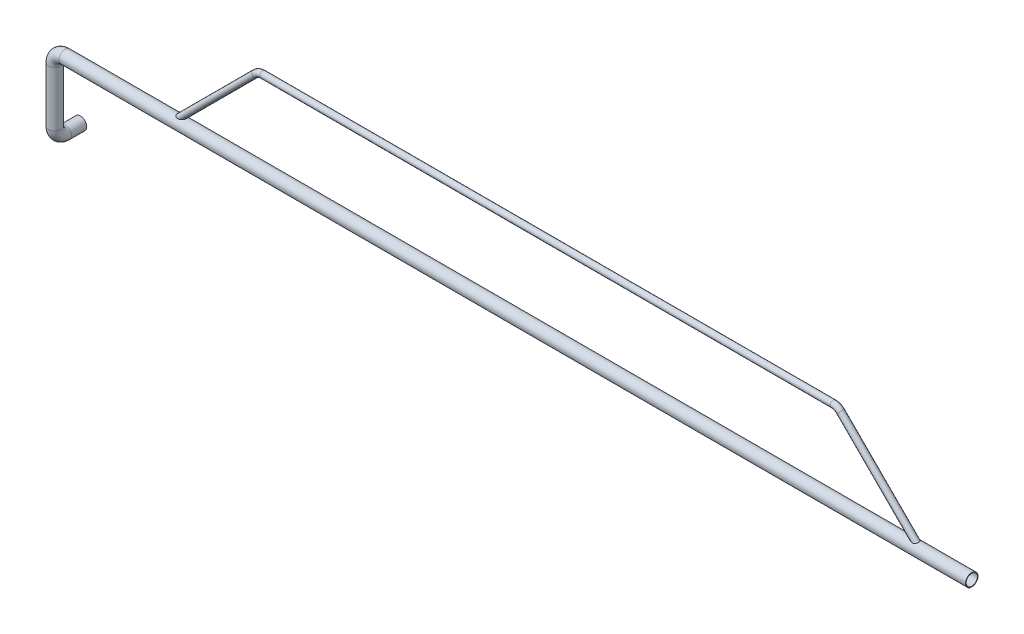
ISO-10303-21;
HEADER;
FILE_DESCRIPTION(('STEP AP214'),'2;1');
FILE_NAME('part.step','',(''),(''),'','','');
FILE_SCHEMA(('AUTOMOTIVE_DESIGN { 1 0 10303 214 1 1 1 1 }'));
ENDSEC;
DATA;
#1=APPLICATION_CONTEXT('core data for automotive mechanical design processes');
#2=APPLICATION_PROTOCOL_DEFINITION('international standard','automotive_design',2000,#1);
#3=PRODUCT_CONTEXT('',#1,'mechanical');
#4=PRODUCT('Part','Part','',(#3));
#5=PRODUCT_RELATED_PRODUCT_CATEGORY('part','',(#4));
#6=PRODUCT_DEFINITION_FORMATION('','',#4);
#7=PRODUCT_DEFINITION_CONTEXT('part definition',#1,'design');
#8=PRODUCT_DEFINITION('design','',#6,#7);
#9=PRODUCT_DEFINITION_SHAPE('','',#8);
#10=(LENGTH_UNIT() NAMED_UNIT(*) SI_UNIT(.MILLI.,.METRE.));
#11=(NAMED_UNIT(*) PLANE_ANGLE_UNIT() SI_UNIT($,.RADIAN.));
#12=(NAMED_UNIT(*) SI_UNIT($,.STERADIAN.) SOLID_ANGLE_UNIT());
#13=UNCERTAINTY_MEASURE_WITH_UNIT(LENGTH_MEASURE(1.E-05),#10,'distance_accuracy_value','');
#14=(GEOMETRIC_REPRESENTATION_CONTEXT(3) GLOBAL_UNCERTAINTY_ASSIGNED_CONTEXT((#13)) GLOBAL_UNIT_ASSIGNED_CONTEXT((#10,
#11,#12)) REPRESENTATION_CONTEXT('',''));
#15=CARTESIAN_POINT('',(0.,0.,0.));
#16=DIRECTION('',(0.,0.,1.));
#17=DIRECTION('',(1.,0.,0.));
#18=AXIS2_PLACEMENT_3D('',#15,#16,#17);
#19=CARTESIAN_POINT('',(-25137.374453509,-8356.2045132641,38950.2492567147));
#20=DIRECTION('',(0.707106781186541,-0.707106781186553,0.));
#21=DIRECTION('',(0.707106781186553,0.707106781186541,0.));
#22=AXIS2_PLACEMENT_3D('',#19,#20,#21);
#23=PLANE('',#22);
#24=CARTESIAN_POINT('',(-25137.374453509,-8356.2045132641,38950.2492567147));
#25=DIRECTION('',(0.707106781186541,-0.707106781186553,0.));
#26=DIRECTION('',(0.707106781186553,0.707106781186542,0.));
#27=AXIS2_PLACEMENT_3D('',#24,#25,#26);
#28=CIRCLE('',#27,12.0000000000006);
#29=CARTESIAN_POINT('',(-25128.8891721347,-8347.71923188986,38950.2492567147));
#30=VERTEX_POINT('',#29);
#31=EDGE_CURVE('E96',#30,#30,#28,.T.);
#32=ORIENTED_EDGE('',*,*,#31,.F.);
#33=EDGE_LOOP('',(#32));
#34=FACE_BOUND('',#33,.T.);
#35=CARTESIAN_POINT('',(-25137.374453509,-8356.2045132641,38950.2492567147));
#36=DIRECTION('',(0.707106781186541,-0.707106781186553,0.));
#37=DIRECTION('',(0.707106781186553,0.707106781186541,0.));
#38=AXIS2_PLACEMENT_3D('',#35,#36,#37);
#39=CIRCLE('',#38,15.0000000000006);
#40=CARTESIAN_POINT('',(-25126.7678517912,-8345.59791154631,38950.2492567147));
#41=VERTEX_POINT('',#40);
#42=EDGE_CURVE('E89',#41,#41,#39,.T.);
#43=ORIENTED_EDGE('',*,*,#42,.T.);
#44=EDGE_LOOP('',(#43));
#45=FACE_BOUND('',#44,.T.);
#46=ADVANCED_FACE('F67',(#34,#45),#23,.T.);
#47=CARTESIAN_POINT('',(-28718.197596503,-8356.2045132641,38950.2492567147));
#48=DIRECTION('',(0.707106781186553,0.707106781186542,0.));
#49=DIRECTION('',(-0.707106781186542,0.707106781186553,0.));
#50=AXIS2_PLACEMENT_3D('',#47,#48,#49);
#51=PLANE('',#50);
#52=CARTESIAN_POINT('',(-28718.197596503,-8356.2045132641,38950.2492567147));
#53=DIRECTION('',(0.707106781186553,0.707106781186542,0.));
#54=DIRECTION('',(-0.707106781186542,0.707106781186553,0.));
#55=AXIS2_PLACEMENT_3D('',#52,#53,#54);
#56=CIRCLE('',#55,12.0000000000006);
#57=CARTESIAN_POINT('',(-28726.6828778773,-8347.71923188986,38950.2492567147));
#58=VERTEX_POINT('',#57);
#59=EDGE_CURVE('E92',#58,#58,#56,.T.);
#60=ORIENTED_EDGE('',*,*,#59,.T.);
#61=EDGE_LOOP('',(#60));
#62=FACE_BOUND('',#61,.T.);
#63=CARTESIAN_POINT('',(-28718.197596503,-8356.2045132641,38950.2492567147));
#64=DIRECTION('',(0.707106781186553,0.707106781186542,0.));
#65=DIRECTION('',(-0.707106781186542,0.707106781186553,0.));
#66=AXIS2_PLACEMENT_3D('',#63,#64,#65);
#67=CIRCLE('',#66,15.0000000000006);
#68=CARTESIAN_POINT('',(-28728.8041982208,-8345.5979115463,38950.2492567147));
#69=VERTEX_POINT('',#68);
#70=EDGE_CURVE('E12',#69,#69,#67,.T.);
#71=ORIENTED_EDGE('',*,*,#70,.F.);
#72=EDGE_LOOP('',(#71));
#73=FACE_BOUND('',#72,.T.);
#74=ADVANCED_FACE('F122',(#62,#73),#51,.F.);
#75=CARTESIAN_POINT('',(-25137.374453509,-8356.2045132641,38950.2492567147));
#76=DIRECTION('',(-0.707106781186548,0.707106781186548,0.));
#77=DIRECTION('',(-0.707106781186548,-0.707106781186548,0.));
#78=AXIS2_PLACEMENT_3D('',#75,#76,#77);
#79=CYLINDRICAL_SURFACE('',#78,15.0000000000006);
#80=CARTESIAN_POINT('',(-25522.7297925683,-7970.84917420477,38950.2492567147));
#81=DIRECTION('',(0.707106781186541,-0.707106781186553,0.));
#82=DIRECTION('',(0.707106781186553,0.707106781186541,0.));
#83=AXIS2_PLACEMENT_3D('',#80,#81,#82);
#84=CIRCLE('',#83,15.0000000000006);
#85=CARTESIAN_POINT('',(-25512.1231908505,-7960.24257248697,38950.2492567147));
#86=VERTEX_POINT('',#85);
#87=EDGE_CURVE('E86',#86,#86,#84,.T.);
#88=ORIENTED_EDGE('',*,*,#87,.T.);
#89=EDGE_LOOP('',(#88));
#90=FACE_BOUND('',#89,.T.);
#91=ORIENTED_EDGE('',*,*,#42,.F.);
#92=EDGE_LOOP('',(#91));
#93=FACE_BOUND('',#92,.T.);
#94=ADVANCED_FACE('F126',(#90,#93),#79,.T.);
#95=CARTESIAN_POINT('',(-25558.0851316276,-8006.2045132641,38950.2492567147));
#96=DIRECTION('',(0.,0.,1.));
#97=DIRECTION('',(1.,0.,0.));
#98=AXIS2_PLACEMENT_3D('',#95,#96,#97);
#99=TOROIDAL_SURFACE('',#98,49.9999999999986,15.0000000000006);
#100=CARTESIAN_POINT('',(-25558.0851316276,-7956.2045132641,38950.2492567147));
#101=DIRECTION('',(1.,0.,0.));
#102=DIRECTION('',(0.,1.,0.));
#103=AXIS2_PLACEMENT_3D('',#100,#101,#102);
#104=CIRCLE('',#103,15.0000000000006);
#105=CARTESIAN_POINT('',(-25558.0851316276,-7941.2045132641,38950.2492567147));
#106=VERTEX_POINT('',#105);
#107=EDGE_CURVE('E81',#106,#106,#104,.T.);
#108=CARTESIAN_POINT('',(-25558.0851316276,-8006.2045132641,38950.2492567147));
#109=DIRECTION('',(0.,0.,1.));
#110=DIRECTION('',(1.,0.,0.));
#111=AXIS2_PLACEMENT_3D('',#108,#109,#110);
#112=CIRCLE('',#111,64.9999999999992);
#113=EDGE_CURVE('',#86,#106,#112,.T.);
#114=ORIENTED_EDGE('',*,*,#87,.F.);
#115=ORIENTED_EDGE('',*,*,#107,.T.);
#116=ORIENTED_EDGE('',*,*,#113,.T.);
#117=ORIENTED_EDGE('',*,*,#113,.F.);
#118=EDGE_LOOP('',(#114,#116,#115,#117));
#119=FACE_BOUND('',#118,.T.);
#120=ADVANCED_FACE('F128',(#119),#99,.T.);
#121=CARTESIAN_POINT('',(-25558.0851316276,-7956.2045132641,38950.2492567147));
#122=DIRECTION('',(-1.,0.,0.));
#123=DIRECTION('',(0.,0.,1.));
#124=AXIS2_PLACEMENT_3D('',#121,#122,#123);
#125=CYLINDRICAL_SURFACE('',#124,15.0000000000006);
#126=CARTESIAN_POINT('',(-28297.4869183844,-7956.2045132641,38950.2492567147));
#127=DIRECTION('',(1.,0.,0.));
#128=DIRECTION('',(0.,1.,0.));
#129=AXIS2_PLACEMENT_3D('',#126,#127,#128);
#130=CIRCLE('',#129,15.0000000000006);
#131=CARTESIAN_POINT('',(-28297.4869183844,-7941.2045132641,38950.2492567147));
#132=VERTEX_POINT('',#131);
#133=EDGE_CURVE('E77',#132,#132,#130,.T.);
#134=ORIENTED_EDGE('',*,*,#133,.T.);
#135=EDGE_LOOP('',(#134));
#136=FACE_BOUND('',#135,.T.);
#137=ORIENTED_EDGE('',*,*,#107,.F.);
#138=EDGE_LOOP('',(#137));
#139=FACE_BOUND('',#138,.T.);
#140=ADVANCED_FACE('F135',(#136,#139),#125,.T.);
#141=CARTESIAN_POINT('',(-28297.4869183844,-8006.2045132641,38950.2492567147));
#142=DIRECTION('',(0.,0.,1.));
#143=DIRECTION('',(1.,0.,0.));
#144=AXIS2_PLACEMENT_3D('',#141,#142,#143);
#145=TOROIDAL_SURFACE('',#144,50.0000000000025,15.0000000000006);
#146=CARTESIAN_POINT('',(-28332.8422574438,-7970.84917420444,38950.2492567147));
#147=DIRECTION('',(0.707106781186553,0.707106781186542,0.));
#148=DIRECTION('',(-0.707106781186542,0.707106781186553,0.));
#149=AXIS2_PLACEMENT_3D('',#146,#147,#148);
#150=CIRCLE('',#149,15.0000000000006);
#151=CARTESIAN_POINT('',(-28343.4488591614,-7960.24257248682,38950.2492567147));
#152=VERTEX_POINT('',#151);
#153=EDGE_CURVE('E73',#152,#152,#150,.T.);
#154=CARTESIAN_POINT('',(-28297.4869183844,-8006.2045132641,38950.2492567147));
#155=DIRECTION('',(0.,0.,1.));
#156=DIRECTION('',(1.,0.,0.));
#157=AXIS2_PLACEMENT_3D('',#154,#155,#156);
#158=CIRCLE('',#157,65.0000000000031);
#159=EDGE_CURVE('',#132,#152,#158,.T.);
#160=ORIENTED_EDGE('',*,*,#133,.F.);
#161=ORIENTED_EDGE('',*,*,#153,.T.);
#162=ORIENTED_EDGE('',*,*,#159,.T.);
#163=ORIENTED_EDGE('',*,*,#159,.F.);
#164=EDGE_LOOP('',(#160,#162,#161,#163));
#165=FACE_BOUND('',#164,.T.);
#166=ADVANCED_FACE('F141',(#165),#145,.T.);
#167=CARTESIAN_POINT('',(-28332.8422574437,-7970.84917420477,38950.2492567147));
#168=DIRECTION('',(-0.707106781186547,-0.707106781186548,0.));
#169=DIRECTION('',(0.707106781186548,-0.707106781186547,0.));
#170=AXIS2_PLACEMENT_3D('',#167,#168,#169);
#171=CYLINDRICAL_SURFACE('',#170,15.0000000000006);
#172=ORIENTED_EDGE('',*,*,#70,.T.);
#173=EDGE_LOOP('',(#172));
#174=FACE_BOUND('',#173,.T.);
#175=ORIENTED_EDGE('',*,*,#153,.F.);
#176=EDGE_LOOP('',(#175));
#177=FACE_BOUND('',#176,.T.);
#178=ADVANCED_FACE('F116',(#174,#177),#171,.T.);
#179=CARTESIAN_POINT('',(-25137.374453509,-8356.2045132641,38950.2492567147));
#180=DIRECTION('',(-0.707106781186548,0.707106781186548,0.));
#181=DIRECTION('',(-0.707106781186548,-0.707106781186548,0.));
#182=AXIS2_PLACEMENT_3D('',#179,#180,#181);
#183=CYLINDRICAL_SURFACE('',#182,12.0000000000006);
#184=CARTESIAN_POINT('',(-25522.7297925683,-7970.84917420478,38950.2492567147));
#185=DIRECTION('',(-0.707106781186548,0.707106781186548,0.));
#186=DIRECTION('',(-0.707106781186548,-0.707106781186548,0.));
#187=AXIS2_PLACEMENT_3D('',#184,#185,#186);
#188=CIRCLE('',#187,12.0000000000006);
#189=CARTESIAN_POINT('',(-25514.244511194,-7962.36389283053,38950.2492567147));
#190=VERTEX_POINT('',#189);
#191=EDGE_CURVE('E99',#190,#190,#188,.F.);
#192=ORIENTED_EDGE('',*,*,#191,.F.);
#193=EDGE_LOOP('',(#192));
#194=FACE_BOUND('',#193,.T.);
#195=ORIENTED_EDGE('',*,*,#31,.T.);
#196=EDGE_LOOP('',(#195));
#197=FACE_BOUND('',#196,.T.);
#198=ADVANCED_FACE('F113',(#194,#197),#183,.F.);
#199=CARTESIAN_POINT('',(-25558.0851316276,-8006.2045132641,38950.2492567147));
#200=DIRECTION('',(0.,0.,1.));
#201=DIRECTION('',(1.,0.,0.));
#202=AXIS2_PLACEMENT_3D('',#199,#200,#201);
#203=TOROIDAL_SURFACE('',#202,49.9999999999986,12.0000000000006);
#204=CARTESIAN_POINT('',(-25558.0851316276,-7956.2045132641,38950.2492567147));
#205=DIRECTION('',(1.,0.,0.));
#206=DIRECTION('',(0.,1.,0.));
#207=AXIS2_PLACEMENT_3D('',#204,#205,#206);
#208=CIRCLE('',#207,12.0000000000006);
#209=CARTESIAN_POINT('',(-25558.0851316276,-7944.2045132641,38950.2492567147));
#210=VERTEX_POINT('',#209);
#211=EDGE_CURVE('E105',#210,#210,#208,.T.);
#212=CARTESIAN_POINT('',(-25558.0851316276,-8006.2045132641,38950.2492567147));
#213=DIRECTION('',(0.,0.,1.));
#214=DIRECTION('',(1.,0.,0.));
#215=AXIS2_PLACEMENT_3D('',#212,#213,#214);
#216=CIRCLE('',#215,61.9999999999992);
#217=EDGE_CURVE('',#190,#210,#216,.T.);
#218=ORIENTED_EDGE('',*,*,#191,.T.);
#219=ORIENTED_EDGE('',*,*,#211,.F.);
#220=ORIENTED_EDGE('',*,*,#217,.T.);
#221=ORIENTED_EDGE('',*,*,#217,.F.);
#222=EDGE_LOOP('',(#218,#220,#219,#221));
#223=FACE_BOUND('',#222,.T.);
#224=ADVANCED_FACE('F111',(#223),#203,.F.);
#225=CARTESIAN_POINT('',(-25558.0851316276,-7956.2045132641,38950.2492567147));
#226=DIRECTION('',(-1.,0.,0.));
#227=DIRECTION('',(0.,0.,1.));
#228=AXIS2_PLACEMENT_3D('',#225,#226,#227);
#229=CYLINDRICAL_SURFACE('',#228,12.0000000000006);
#230=CARTESIAN_POINT('',(-28297.4869183844,-7956.2045132641,38950.2492567147));
#231=DIRECTION('',(-1.,0.,0.));
#232=DIRECTION('',(0.,0.,1.));
#233=AXIS2_PLACEMENT_3D('',#230,#231,#232);
#234=CIRCLE('',#233,12.0000000000006);
#235=CARTESIAN_POINT('',(-28297.4869183844,-7944.2045132641,38950.2492567147));
#236=VERTEX_POINT('',#235);
#237=EDGE_CURVE('E102',#236,#236,#234,.F.);
#238=ORIENTED_EDGE('',*,*,#237,.F.);
#239=EDGE_LOOP('',(#238));
#240=FACE_BOUND('',#239,.T.);
#241=ORIENTED_EDGE('',*,*,#211,.T.);
#242=EDGE_LOOP('',(#241));
#243=FACE_BOUND('',#242,.T.);
#244=ADVANCED_FACE('F187',(#240,#243),#229,.F.);
#245=CARTESIAN_POINT('',(-28297.4869183844,-8006.2045132641,38950.2492567147));
#246=DIRECTION('',(0.,0.,1.));
#247=DIRECTION('',(1.,0.,0.));
#248=AXIS2_PLACEMENT_3D('',#245,#246,#247);
#249=TOROIDAL_SURFACE('',#248,50.0000000000025,12.0000000000006);
#250=CARTESIAN_POINT('',(-28332.8422574435,-7970.8491742046,38950.2492567147));
#251=DIRECTION('',(0.707106781189885,0.70710678118321,0.));
#252=DIRECTION('',(-0.70710678118321,0.707106781189885,0.));
#253=AXIS2_PLACEMENT_3D('',#250,#251,#252);
#254=CIRCLE('',#253,12.0000000000006);
#255=CARTESIAN_POINT('',(-28341.3275388177,-7962.36389283033,38950.2492567147));
#256=VERTEX_POINT('',#255);
#257=EDGE_CURVE('E95',#256,#256,#254,.T.);
#258=CARTESIAN_POINT('',(-28297.4869183844,-8006.2045132641,38950.2492567147));
#259=DIRECTION('',(0.,0.,1.));
#260=DIRECTION('',(1.,0.,0.));
#261=AXIS2_PLACEMENT_3D('',#258,#259,#260);
#262=CIRCLE('',#261,62.0000000000031);
#263=EDGE_CURVE('',#236,#256,#262,.T.);
#264=ORIENTED_EDGE('',*,*,#237,.T.);
#265=ORIENTED_EDGE('',*,*,#257,.F.);
#266=ORIENTED_EDGE('',*,*,#263,.T.);
#267=ORIENTED_EDGE('',*,*,#263,.F.);
#268=EDGE_LOOP('',(#264,#266,#265,#267));
#269=FACE_BOUND('',#268,.T.);
#270=ADVANCED_FACE('F198',(#269),#249,.F.);
#271=CARTESIAN_POINT('',(-28332.8422574437,-7970.84917420477,38950.2492567147));
#272=DIRECTION('',(-0.707106781186547,-0.707106781186548,0.));
#273=DIRECTION('',(0.707106781186548,-0.707106781186547,0.));
#274=AXIS2_PLACEMENT_3D('',#271,#272,#273);
#275=CYLINDRICAL_SURFACE('',#274,12.0000000000006);
#276=ORIENTED_EDGE('',*,*,#59,.F.);
#277=EDGE_LOOP('',(#276));
#278=FACE_BOUND('',#277,.T.);
#279=ORIENTED_EDGE('',*,*,#257,.T.);
#280=EDGE_LOOP('',(#279));
#281=FACE_BOUND('',#280,.T.);
#282=ADVANCED_FACE('F123',(#278,#281),#275,.F.);
#283=CLOSED_SHELL('',(#46,#74,#94,#120,#140,#166,#178,#198,#224,#244,#270,#282));
#284=MANIFOLD_SOLID_BREP('B2',#283);
#285=CARTESIAN_POINT('',(-24893.0061834818,-8356.2045132641,38950.2492567147));
#286=DIRECTION('',(1.,-1.93716421499442E-13,0.));
#287=DIRECTION('',(-1.93716421499442E-13,-1.,0.));
#288=AXIS2_PLACEMENT_3D('',#285,#286,#287);
#289=PLANE('',#288);
#290=CARTESIAN_POINT('',(-24893.0061834818,-8356.2045132641,38950.2492567147));
#291=DIRECTION('',(1.,-1.93716421499442E-13,0.));
#292=DIRECTION('',(1.93716421499442E-13,1.,0.));
#293=AXIS2_PLACEMENT_3D('',#290,#291,#292);
#294=CIRCLE('',#293,27.0000000000011);
#295=CARTESIAN_POINT('',(-24893.0061834818,-8329.2045132641,38950.2492567147));
#296=VERTEX_POINT('',#295);
#297=EDGE_CURVE('E302',#296,#296,#294,.T.);
#298=ORIENTED_EDGE('',*,*,#297,.F.);
#299=EDGE_LOOP('',(#298));
#300=FACE_BOUND('',#299,.T.);
#301=CARTESIAN_POINT('',(-24893.0061834818,-8356.2045132641,38950.2492567147));
#302=DIRECTION('',(1.,-1.93716421499442E-13,0.));
#303=DIRECTION('',(-1.93716421499442E-13,-1.,0.));
#304=AXIS2_PLACEMENT_3D('',#301,#302,#303);
#305=CIRCLE('',#304,30.0000000000011);
#306=CARTESIAN_POINT('',(-24893.0061834818,-8386.2045132641,38950.2492567147));
#307=VERTEX_POINT('',#306);
#308=EDGE_CURVE('E295',#307,#307,#305,.T.);
#309=ORIENTED_EDGE('',*,*,#308,.T.);
#310=EDGE_LOOP('',(#309));
#311=FACE_BOUND('',#310,.T.);
#312=ADVANCED_FACE('F273',(#300,#311),#289,.T.);
#313=CARTESIAN_POINT('',(-29296.5546832918,-8720.51863341394,38826.8901960568));
#314=DIRECTION('',(0.,0.,1.));
#315=DIRECTION('',(1.,0.,0.));
#316=AXIS2_PLACEMENT_3D('',#313,#314,#315);
#317=PLANE('',#316);
#318=CARTESIAN_POINT('',(-29296.5546832918,-8720.51863341394,38826.8901960568));
#319=DIRECTION('',(0.,0.,1.));
#320=DIRECTION('',(1.,0.,0.));
#321=AXIS2_PLACEMENT_3D('',#318,#319,#320);
#322=CIRCLE('',#321,27.0000000000011);
#323=CARTESIAN_POINT('',(-29269.5546832918,-8720.51863341394,38826.8901960568));
#324=VERTEX_POINT('',#323);
#325=EDGE_CURVE('E298',#324,#324,#322,.T.);
#326=ORIENTED_EDGE('',*,*,#325,.T.);
#327=EDGE_LOOP('',(#326));
#328=FACE_BOUND('',#327,.T.);
#329=CARTESIAN_POINT('',(-29296.5546832918,-8720.51863341394,38826.8901960568));
#330=DIRECTION('',(0.,0.,1.));
#331=DIRECTION('',(1.,0.,0.));
#332=AXIS2_PLACEMENT_3D('',#329,#330,#331);
#333=CIRCLE('',#332,30.0000000000011);
#334=CARTESIAN_POINT('',(-29266.5546832918,-8720.51863341394,38826.8901960568));
#335=VERTEX_POINT('',#334);
#336=EDGE_CURVE('E66',#335,#335,#333,.T.);
#337=ORIENTED_EDGE('',*,*,#336,.F.);
#338=EDGE_LOOP('',(#337));
#339=FACE_BOUND('',#338,.T.);
#340=ADVANCED_FACE('F328',(#328,#339),#317,.F.);
#341=CARTESIAN_POINT('',(-24893.0061834818,-8356.2045132641,38950.2492567147));
#342=DIRECTION('',(-1.,0.,0.));
#343=DIRECTION('',(0.,0.,1.));
#344=AXIS2_PLACEMENT_3D('',#341,#342,#343);
#345=CYLINDRICAL_SURFACE('',#344,30.0000000000011);
#346=CARTESIAN_POINT('',(-29246.5546832918,-8356.2045132641,38950.2492567147));
#347=DIRECTION('',(1.,-1.93716421499442E-13,0.));
#348=DIRECTION('',(-1.93716421499442E-13,-1.,0.));
#349=AXIS2_PLACEMENT_3D('',#346,#347,#348);
#350=CIRCLE('',#349,30.0000000000011);
#351=CARTESIAN_POINT('',(-29246.5546832918,-8326.2045132641,38950.2492567147));
#352=VERTEX_POINT('',#351);
#353=EDGE_CURVE('E292',#352,#352,#350,.T.);
#354=ORIENTED_EDGE('',*,*,#353,.T.);
#355=EDGE_LOOP('',(#354));
#356=FACE_BOUND('',#355,.T.);
#357=ORIENTED_EDGE('',*,*,#308,.F.);
#358=EDGE_LOOP('',(#357));
#359=FACE_BOUND('',#358,.T.);
#360=ADVANCED_FACE('F332',(#356,#359),#345,.T.);
#361=CARTESIAN_POINT('',(-29246.5546832918,-8406.2045132641,38950.2492567147));
#362=DIRECTION('',(0.,0.,1.));
#363=DIRECTION('',(1.,0.,0.));
#364=AXIS2_PLACEMENT_3D('',#361,#362,#363);
#365=TOROIDAL_SURFACE('',#364,50.0000000000043,30.0000000000011);
#366=CARTESIAN_POINT('',(-29296.5546832918,-8406.20451326411,38950.2492567147));
#367=DIRECTION('',(1.93716421499442E-13,1.,0.));
#368=DIRECTION('',(1.,-1.93716421499442E-13,0.));
#369=AXIS2_PLACEMENT_3D('',#366,#367,#368);
#370=CIRCLE('',#369,30.0000000000011);
#371=CARTESIAN_POINT('',(-29326.5546832918,-8406.20451326411,38950.2492567147));
#372=VERTEX_POINT('',#371);
#373=EDGE_CURVE('E287',#372,#372,#370,.T.);
#374=CARTESIAN_POINT('',(-29246.5546832918,-8406.2045132641,38950.2492567147));
#375=DIRECTION('',(0.,0.,1.));
#376=DIRECTION('',(1.,0.,0.));
#377=AXIS2_PLACEMENT_3D('',#374,#375,#376);
#378=CIRCLE('',#377,80.0000000000054);
#379=EDGE_CURVE('',#352,#372,#378,.T.);
#380=ORIENTED_EDGE('',*,*,#353,.F.);
#381=ORIENTED_EDGE('',*,*,#373,.T.);
#382=ORIENTED_EDGE('',*,*,#379,.T.);
#383=ORIENTED_EDGE('',*,*,#379,.F.);
#384=EDGE_LOOP('',(#380,#382,#381,#383));
#385=FACE_BOUND('',#384,.T.);
#386=ADVANCED_FACE('F334',(#385),#365,.T.);
#387=CARTESIAN_POINT('',(-29296.5546832918,-8406.20451326411,38950.2492567147));
#388=DIRECTION('',(0.,-1.,0.));
#389=DIRECTION('',(0.,0.,-1.));
#390=AXIS2_PLACEMENT_3D('',#387,#388,#389);
#391=CYLINDRICAL_SURFACE('',#390,30.0000000000011);
#392=CARTESIAN_POINT('',(-29296.5546832918,-8670.51863341394,38950.2492567147));
#393=DIRECTION('',(1.93716421499442E-13,1.,0.));
#394=DIRECTION('',(1.,-1.93716421499442E-13,0.));
#395=AXIS2_PLACEMENT_3D('',#392,#393,#394);
#396=CIRCLE('',#395,30.0000000000011);
#397=CARTESIAN_POINT('',(-29296.5546832918,-8670.51863341394,38980.2492567147));
#398=VERTEX_POINT('',#397);
#399=EDGE_CURVE('E283',#398,#398,#396,.T.);
#400=ORIENTED_EDGE('',*,*,#399,.T.);
#401=EDGE_LOOP('',(#400));
#402=FACE_BOUND('',#401,.T.);
#403=ORIENTED_EDGE('',*,*,#373,.F.);
#404=EDGE_LOOP('',(#403));
#405=FACE_BOUND('',#404,.T.);
#406=ADVANCED_FACE('F341',(#402,#405),#391,.T.);
#407=CARTESIAN_POINT('',(-29296.5546832918,-8670.51863341394,38900.2492567147));
#408=DIRECTION('',(1.,0.,0.));
#409=DIRECTION('',(0.,0.,-1.));
#410=AXIS2_PLACEMENT_3D('',#407,#408,#409);
#411=TOROIDAL_SURFACE('',#410,49.9999999999972,30.0000000000011);
#412=CARTESIAN_POINT('',(-29296.5546832993,-8720.51863341488,38900.2492567088));
#413=DIRECTION('',(0.,0.,1.));
#414=DIRECTION('',(1.,0.,0.));
#415=AXIS2_PLACEMENT_3D('',#412,#413,#414);
#416=CIRCLE('',#415,30.0000000000011);
#417=CARTESIAN_POINT('',(-29296.5546833039,-8750.51863341394,38900.2492567053));
#418=VERTEX_POINT('',#417);
#419=EDGE_CURVE('E279',#418,#418,#416,.T.);
#420=CARTESIAN_POINT('',(-29296.5546832918,-8670.51863341394,38900.2492567147));
#421=DIRECTION('',(1.,0.,0.));
#422=DIRECTION('',(0.,0.,-1.));
#423=AXIS2_PLACEMENT_3D('',#420,#421,#422);
#424=CIRCLE('',#423,79.9999999999983);
#425=EDGE_CURVE('',#398,#418,#424,.T.);
#426=ORIENTED_EDGE('',*,*,#399,.F.);
#427=ORIENTED_EDGE('',*,*,#419,.T.);
#428=ORIENTED_EDGE('',*,*,#425,.T.);
#429=ORIENTED_EDGE('',*,*,#425,.F.);
#430=EDGE_LOOP('',(#426,#428,#427,#429));
#431=FACE_BOUND('',#430,.T.);
#432=ADVANCED_FACE('F347',(#431),#411,.T.);
#433=CARTESIAN_POINT('',(-29296.5546832918,-8720.51863341394,38900.2492567147));
#434=DIRECTION('',(1.93716421499442E-13,0.,-1.));
#435=DIRECTION('',(-1.,0.,-1.93716421499442E-13));
#436=AXIS2_PLACEMENT_3D('',#433,#434,#435);
#437=CYLINDRICAL_SURFACE('',#436,30.0000000000011);
#438=ORIENTED_EDGE('',*,*,#336,.T.);
#439=EDGE_LOOP('',(#438));
#440=FACE_BOUND('',#439,.T.);
#441=ORIENTED_EDGE('',*,*,#419,.F.);
#442=EDGE_LOOP('',(#441));
#443=FACE_BOUND('',#442,.T.);
#444=ADVANCED_FACE('F322',(#440,#443),#437,.T.);
#445=CARTESIAN_POINT('',(-24893.0061834818,-8356.2045132641,38950.2492567147));
#446=DIRECTION('',(-1.,0.,0.));
#447=DIRECTION('',(0.,0.,1.));
#448=AXIS2_PLACEMENT_3D('',#445,#446,#447);
#449=CYLINDRICAL_SURFACE('',#448,27.0000000000011);
#450=CARTESIAN_POINT('',(-29246.5546832918,-8356.2045132641,38950.2492567147));
#451=DIRECTION('',(-1.,0.,0.));
#452=DIRECTION('',(0.,0.,1.));
#453=AXIS2_PLACEMENT_3D('',#450,#451,#452);
#454=CIRCLE('',#453,27.0000000000011);
#455=CARTESIAN_POINT('',(-29246.5546832918,-8329.2045132641,38950.2492567147));
#456=VERTEX_POINT('',#455);
#457=EDGE_CURVE('E305',#456,#456,#454,.F.);
#458=ORIENTED_EDGE('',*,*,#457,.F.);
#459=EDGE_LOOP('',(#458));
#460=FACE_BOUND('',#459,.T.);
#461=ORIENTED_EDGE('',*,*,#297,.T.);
#462=EDGE_LOOP('',(#461));
#463=FACE_BOUND('',#462,.T.);
#464=ADVANCED_FACE('F319',(#460,#463),#449,.F.);
#465=CARTESIAN_POINT('',(-29246.5546832918,-8406.2045132641,38950.2492567147));
#466=DIRECTION('',(0.,0.,1.));
#467=DIRECTION('',(1.,0.,0.));
#468=AXIS2_PLACEMENT_3D('',#465,#466,#467);
#469=TOROIDAL_SURFACE('',#468,50.0000000000043,27.0000000000011);
#470=CARTESIAN_POINT('',(-29296.5546832918,-8406.2045132641,38950.2492567147));
#471=DIRECTION('',(0.,1.,0.));
#472=DIRECTION('',(-1.,0.,0.));
#473=AXIS2_PLACEMENT_3D('',#470,#471,#472);
#474=CIRCLE('',#473,27.0000000000011);
#475=CARTESIAN_POINT('',(-29323.5546832918,-8406.2045132641,38950.2492567147));
#476=VERTEX_POINT('',#475);
#477=EDGE_CURVE('E311',#476,#476,#474,.T.);
#478=CARTESIAN_POINT('',(-29246.5546832918,-8406.2045132641,38950.2492567147));
#479=DIRECTION('',(0.,0.,1.));
#480=DIRECTION('',(1.,0.,0.));
#481=AXIS2_PLACEMENT_3D('',#478,#479,#480);
#482=CIRCLE('',#481,77.0000000000054);
#483=EDGE_CURVE('',#456,#476,#482,.T.);
#484=ORIENTED_EDGE('',*,*,#457,.T.);
#485=ORIENTED_EDGE('',*,*,#477,.F.);
#486=ORIENTED_EDGE('',*,*,#483,.T.);
#487=ORIENTED_EDGE('',*,*,#483,.F.);
#488=EDGE_LOOP('',(#484,#486,#485,#487));
#489=FACE_BOUND('',#488,.T.);
#490=ADVANCED_FACE('F317',(#489),#469,.F.);
#491=CARTESIAN_POINT('',(-29296.5546832918,-8406.20451326411,38950.2492567147));
#492=DIRECTION('',(0.,-1.,0.));
#493=DIRECTION('',(0.,0.,-1.));
#494=AXIS2_PLACEMENT_3D('',#491,#492,#493);
#495=CYLINDRICAL_SURFACE('',#494,27.0000000000011);
#496=CARTESIAN_POINT('',(-29296.5546832918,-8670.51863341395,38950.2492567147));
#497=DIRECTION('',(0.,-1.,0.));
#498=DIRECTION('',(0.,0.,-1.));
#499=AXIS2_PLACEMENT_3D('',#496,#497,#498);
#500=CIRCLE('',#499,27.0000000000011);
#501=CARTESIAN_POINT('',(-29296.5546832918,-8670.51863341395,38977.2492567147));
#502=VERTEX_POINT('',#501);
#503=EDGE_CURVE('E308',#502,#502,#500,.F.);
#504=ORIENTED_EDGE('',*,*,#503,.F.);
#505=EDGE_LOOP('',(#504));
#506=FACE_BOUND('',#505,.T.);
#507=ORIENTED_EDGE('',*,*,#477,.T.);
#508=EDGE_LOOP('',(#507));
#509=FACE_BOUND('',#508,.T.);
#510=ADVANCED_FACE('F393',(#506,#509),#495,.F.);
#511=CARTESIAN_POINT('',(-29296.5546832918,-8670.51863341394,38900.2492567147));
#512=DIRECTION('',(1.,0.,0.));
#513=DIRECTION('',(0.,0.,-1.));
#514=AXIS2_PLACEMENT_3D('',#511,#512,#513);
#515=TOROIDAL_SURFACE('',#514,49.9999999999972,27.0000000000011);
#516=CARTESIAN_POINT('',(-29296.5546832918,-8720.51863341394,38900.2492567088));
#517=DIRECTION('',(1.93716421499442E-13,0.,-1.));
#518=DIRECTION('',(-1.,0.,-1.93716421499442E-13));
#519=AXIS2_PLACEMENT_3D('',#516,#517,#518);
#520=CIRCLE('',#519,27.0000000000011);
#521=CARTESIAN_POINT('',(-29296.5546832918,-8747.51863341394,38900.2492567056));
#522=VERTEX_POINT('',#521);
#523=EDGE_CURVE('E301',#522,#522,#520,.F.);
#524=CARTESIAN_POINT('',(-29296.5546832918,-8670.51863341394,38900.2492567147));
#525=DIRECTION('',(1.,0.,0.));
#526=DIRECTION('',(0.,0.,-1.));
#527=AXIS2_PLACEMENT_3D('',#524,#525,#526);
#528=CIRCLE('',#527,76.9999999999983);
#529=EDGE_CURVE('',#502,#522,#528,.T.);
#530=ORIENTED_EDGE('',*,*,#503,.T.);
#531=ORIENTED_EDGE('',*,*,#523,.F.);
#532=ORIENTED_EDGE('',*,*,#529,.T.);
#533=ORIENTED_EDGE('',*,*,#529,.F.);
#534=EDGE_LOOP('',(#530,#532,#531,#533));
#535=FACE_BOUND('',#534,.T.);
#536=ADVANCED_FACE('F404',(#535),#515,.F.);
#537=CARTESIAN_POINT('',(-29296.5546832918,-8720.51863341394,38900.2492567147));
#538=DIRECTION('',(1.93716421499442E-13,0.,-1.));
#539=DIRECTION('',(-1.,0.,-1.93716421499442E-13));
#540=AXIS2_PLACEMENT_3D('',#537,#538,#539);
#541=CYLINDRICAL_SURFACE('',#540,27.0000000000011);
#542=ORIENTED_EDGE('',*,*,#325,.F.);
#543=EDGE_LOOP('',(#542));
#544=FACE_BOUND('',#543,.T.);
#545=ORIENTED_EDGE('',*,*,#523,.T.);
#546=EDGE_LOOP('',(#545));
#547=FACE_BOUND('',#546,.T.);
#548=ADVANCED_FACE('F329',(#544,#547),#541,.F.);
#549=CLOSED_SHELL('',(#312,#340,#360,#386,#406,#432,#444,#464,#490,#510,#536,#548));
#550=MANIFOLD_SOLID_BREP('B7',#549);
#551=ADVANCED_BREP_SHAPE_REPRESENTATION('',(#18,#284,#550),#14);
#552=SHAPE_DEFINITION_REPRESENTATION(#9,#551);
ENDSEC;
END-ISO-10303-21;
